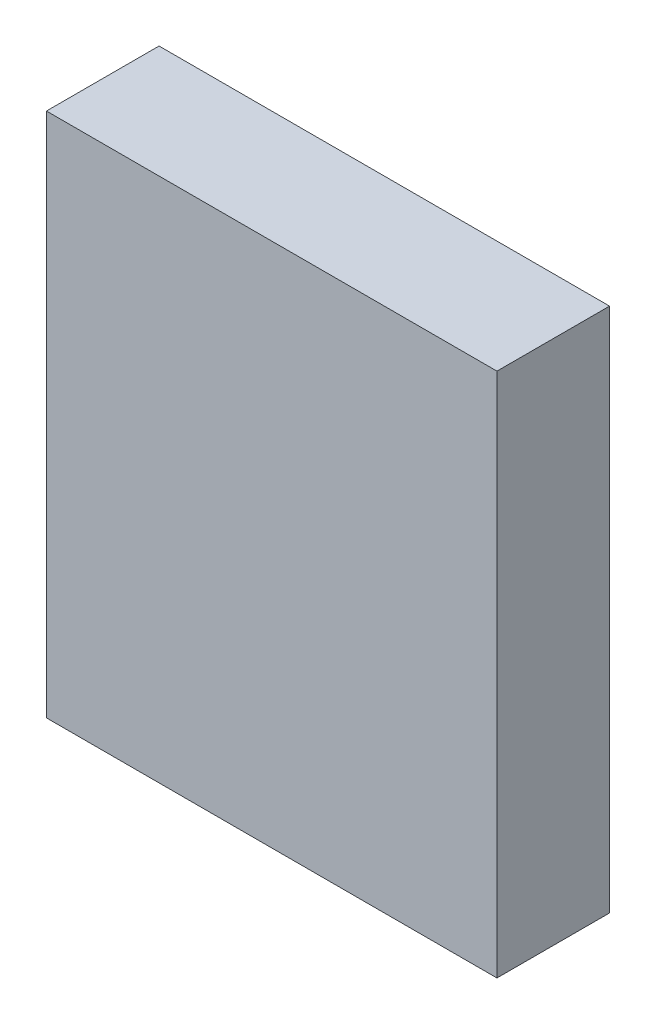
ISO-10303-21;
HEADER;
FILE_DESCRIPTION(('STEP AP214'),'2;1');
FILE_NAME('part.step','',(''),(''),'','','');
FILE_SCHEMA(('AUTOMOTIVE_DESIGN { 1 0 10303 214 1 1 1 1 }'));
ENDSEC;
DATA;
#1=APPLICATION_CONTEXT('core data for automotive mechanical design processes');
#2=APPLICATION_PROTOCOL_DEFINITION('international standard','automotive_design',2000,#1);
#3=PRODUCT_CONTEXT('',#1,'mechanical');
#4=PRODUCT('Part','Part','',(#3));
#5=PRODUCT_RELATED_PRODUCT_CATEGORY('part','',(#4));
#6=PRODUCT_DEFINITION_FORMATION('','',#4);
#7=PRODUCT_DEFINITION_CONTEXT('part definition',#1,'design');
#8=PRODUCT_DEFINITION('design','',#6,#7);
#9=PRODUCT_DEFINITION_SHAPE('','',#8);
#10=(LENGTH_UNIT() NAMED_UNIT(*) SI_UNIT(.MILLI.,.METRE.));
#11=(NAMED_UNIT(*) PLANE_ANGLE_UNIT() SI_UNIT($,.RADIAN.));
#12=(NAMED_UNIT(*) SI_UNIT($,.STERADIAN.) SOLID_ANGLE_UNIT());
#13=UNCERTAINTY_MEASURE_WITH_UNIT(LENGTH_MEASURE(1.E-05),#10,'distance_accuracy_value','');
#14=(GEOMETRIC_REPRESENTATION_CONTEXT(3) GLOBAL_UNCERTAINTY_ASSIGNED_CONTEXT((#13)) GLOBAL_UNIT_ASSIGNED_CONTEXT((#10,
#11,#12)) REPRESENTATION_CONTEXT('',''));
#15=CARTESIAN_POINT('',(0.,0.,0.));
#16=DIRECTION('',(0.,0.,1.));
#17=DIRECTION('',(1.,0.,0.));
#18=AXIS2_PLACEMENT_3D('',#15,#16,#17);
#19=CARTESIAN_POINT('',(0.,1.270000012696E-06,0.1499997));
#20=DIRECTION('',(0.,0.,1.));
#21=DIRECTION('',(1.,0.,0.));
#22=AXIS2_PLACEMENT_3D('',#19,#20,#21);
#23=PLANE('',#22);
#24=DIRECTION('',(0.,1.,0.));
#25=VECTOR('',#24,1.);
#26=CARTESIAN_POINT('',(0.30004004,-0.35003994,0.1499997));
#27=LINE('',#26,#25);
#28=CARTESIAN_POINT('',(0.30004004,-0.35003994,0.1499997));
#29=VERTEX_POINT('',#28);
#30=CARTESIAN_POINT('',(0.30004004,0.35004248,0.1499997));
#31=VERTEX_POINT('',#30);
#32=EDGE_CURVE('E67',#29,#31,#27,.T.);
#33=ORIENTED_EDGE('',*,*,#32,.T.);
#34=DIRECTION('',(-1.,0.,0.));
#35=VECTOR('',#34,1.);
#36=CARTESIAN_POINT('',(0.30004004,0.35004248,0.1499997));
#37=LINE('',#36,#35);
#38=CARTESIAN_POINT('',(-0.30004004,0.35004248,0.1499997));
#39=VERTEX_POINT('',#38);
#40=EDGE_CURVE('E100',#31,#39,#37,.T.);
#41=ORIENTED_EDGE('',*,*,#40,.T.);
#42=DIRECTION('',(0.,-1.,0.));
#43=VECTOR('',#42,1.);
#44=CARTESIAN_POINT('',(-0.30004004,0.35004248,0.1499997));
#45=LINE('',#44,#43);
#46=CARTESIAN_POINT('',(-0.30004004,-0.35003994,0.1499997));
#47=VERTEX_POINT('',#46);
#48=EDGE_CURVE('E70',#39,#47,#45,.T.);
#49=ORIENTED_EDGE('',*,*,#48,.T.);
#50=DIRECTION('',(1.,0.,0.));
#51=VECTOR('',#50,1.);
#52=CARTESIAN_POINT('',(-0.30004004,-0.35003994,0.1499997));
#53=LINE('',#52,#51);
#54=EDGE_CURVE('E11',#47,#29,#53,.T.);
#55=ORIENTED_EDGE('',*,*,#54,.T.);
#56=EDGE_LOOP('',(#33,#41,#49,#55));
#57=FACE_BOUND('',#56,.T.);
#58=ADVANCED_FACE('F16',(#57),#23,.T.);
#59=CARTESIAN_POINT('',(0.,1.270000012696E-06,0.));
#60=DIRECTION('',(0.,0.,1.));
#61=DIRECTION('',(1.,0.,0.));
#62=AXIS2_PLACEMENT_3D('',#59,#60,#61);
#63=PLANE('',#62);
#64=DIRECTION('',(0.,1.,0.));
#65=VECTOR('',#64,1.);
#66=CARTESIAN_POINT('',(0.30004004,-0.35003994,0.));
#67=LINE('',#66,#65);
#68=CARTESIAN_POINT('',(0.30004004,-0.35003994,0.));
#69=VERTEX_POINT('',#68);
#70=CARTESIAN_POINT('',(0.30004004,0.35004248,0.));
#71=VERTEX_POINT('',#70);
#72=EDGE_CURVE('E83',#69,#71,#67,.T.);
#73=ORIENTED_EDGE('',*,*,#72,.F.);
#74=DIRECTION('',(1.,0.,0.));
#75=VECTOR('',#74,1.);
#76=CARTESIAN_POINT('',(-0.30004004,-0.35003994,0.));
#77=LINE('',#76,#75);
#78=CARTESIAN_POINT('',(-0.30004004,-0.35003994,0.));
#79=VERTEX_POINT('',#78);
#80=EDGE_CURVE('E27',#79,#69,#77,.T.);
#81=ORIENTED_EDGE('',*,*,#80,.F.);
#82=DIRECTION('',(0.,-1.,0.));
#83=VECTOR('',#82,1.);
#84=CARTESIAN_POINT('',(-0.30004004,0.35004248,0.));
#85=LINE('',#84,#83);
#86=CARTESIAN_POINT('',(-0.30004004,0.35004248,0.));
#87=VERTEX_POINT('',#86);
#88=EDGE_CURVE('E95',#87,#79,#85,.T.);
#89=ORIENTED_EDGE('',*,*,#88,.F.);
#90=DIRECTION('',(-1.,0.,0.));
#91=VECTOR('',#90,1.);
#92=CARTESIAN_POINT('',(0.30004004,0.35004248,0.));
#93=LINE('',#92,#91);
#94=EDGE_CURVE('E79',#71,#87,#93,.T.);
#95=ORIENTED_EDGE('',*,*,#94,.F.);
#96=EDGE_LOOP('',(#73,#81,#89,#95));
#97=FACE_BOUND('',#96,.T.);
#98=ADVANCED_FACE('F18',(#97),#63,.F.);
#99=CARTESIAN_POINT('',(-0.30004004,-0.35003994,0.));
#100=DIRECTION('',(0.,1.,0.));
#101=DIRECTION('',(1.,0.,0.));
#102=AXIS2_PLACEMENT_3D('',#99,#100,#101);
#103=PLANE('',#102);
#104=DIRECTION('',(0.,0.,1.));
#105=VECTOR('',#104,1.);
#106=CARTESIAN_POINT('',(-0.30004004,-0.35003994,0.));
#107=LINE('',#106,#105);
#108=EDGE_CURVE('E99',#79,#47,#107,.T.);
#109=ORIENTED_EDGE('',*,*,#108,.F.);
#110=ORIENTED_EDGE('',*,*,#80,.T.);
#111=DIRECTION('',(0.,0.,1.));
#112=VECTOR('',#111,1.);
#113=CARTESIAN_POINT('',(0.30004004,-0.35003994,0.));
#114=LINE('',#113,#112);
#115=EDGE_CURVE('E76',#69,#29,#114,.T.);
#116=ORIENTED_EDGE('',*,*,#115,.T.);
#117=ORIENTED_EDGE('',*,*,#54,.F.);
#118=EDGE_LOOP('',(#109,#110,#116,#117));
#119=FACE_BOUND('',#118,.T.);
#120=ADVANCED_FACE('F81',(#119),#103,.F.);
#121=CARTESIAN_POINT('',(-0.30004004,0.35004248,0.));
#122=DIRECTION('',(1.,0.,0.));
#123=DIRECTION('',(0.,1.,0.));
#124=AXIS2_PLACEMENT_3D('',#121,#122,#123);
#125=PLANE('',#124);
#126=DIRECTION('',(0.,0.,1.));
#127=VECTOR('',#126,1.);
#128=CARTESIAN_POINT('',(-0.30004004,0.35004248,0.));
#129=LINE('',#128,#127);
#130=EDGE_CURVE('E94',#87,#39,#129,.T.);
#131=ORIENTED_EDGE('',*,*,#130,.F.);
#132=ORIENTED_EDGE('',*,*,#88,.T.);
#133=ORIENTED_EDGE('',*,*,#108,.T.);
#134=ORIENTED_EDGE('',*,*,#48,.F.);
#135=EDGE_LOOP('',(#131,#132,#133,#134));
#136=FACE_BOUND('',#135,.T.);
#137=ADVANCED_FACE('F114',(#136),#125,.F.);
#138=CARTESIAN_POINT('',(0.30004004,0.35004248,0.));
#139=DIRECTION('',(0.,-1.,0.));
#140=DIRECTION('',(0.,0.,-1.));
#141=AXIS2_PLACEMENT_3D('',#138,#139,#140);
#142=PLANE('',#141);
#143=DIRECTION('',(0.,0.,1.));
#144=VECTOR('',#143,1.);
#145=CARTESIAN_POINT('',(0.30004004,0.35004248,0.));
#146=LINE('',#145,#144);
#147=EDGE_CURVE('E20',#71,#31,#146,.T.);
#148=ORIENTED_EDGE('',*,*,#147,.F.);
#149=ORIENTED_EDGE('',*,*,#94,.T.);
#150=ORIENTED_EDGE('',*,*,#130,.T.);
#151=ORIENTED_EDGE('',*,*,#40,.F.);
#152=EDGE_LOOP('',(#148,#149,#150,#151));
#153=FACE_BOUND('',#152,.T.);
#154=ADVANCED_FACE('F118',(#153),#142,.F.);
#155=CARTESIAN_POINT('',(0.30004004,-0.35003994,0.));
#156=DIRECTION('',(-1.,0.,0.));
#157=DIRECTION('',(0.,0.,1.));
#158=AXIS2_PLACEMENT_3D('',#155,#156,#157);
#159=PLANE('',#158);
#160=ORIENTED_EDGE('',*,*,#115,.F.);
#161=ORIENTED_EDGE('',*,*,#72,.T.);
#162=ORIENTED_EDGE('',*,*,#147,.T.);
#163=ORIENTED_EDGE('',*,*,#32,.F.);
#164=EDGE_LOOP('',(#160,#161,#162,#163));
#165=FACE_BOUND('',#164,.T.);
#166=ADVANCED_FACE('F74',(#165),#159,.F.);
#167=CLOSED_SHELL('',(#58,#98,#120,#137,#154,#166));
#168=MANIFOLD_SOLID_BREP('B1',#167);
#169=ADVANCED_BREP_SHAPE_REPRESENTATION('',(#18,#168),#14);
#170=SHAPE_DEFINITION_REPRESENTATION(#9,#169);
ENDSEC;
END-ISO-10303-21;
